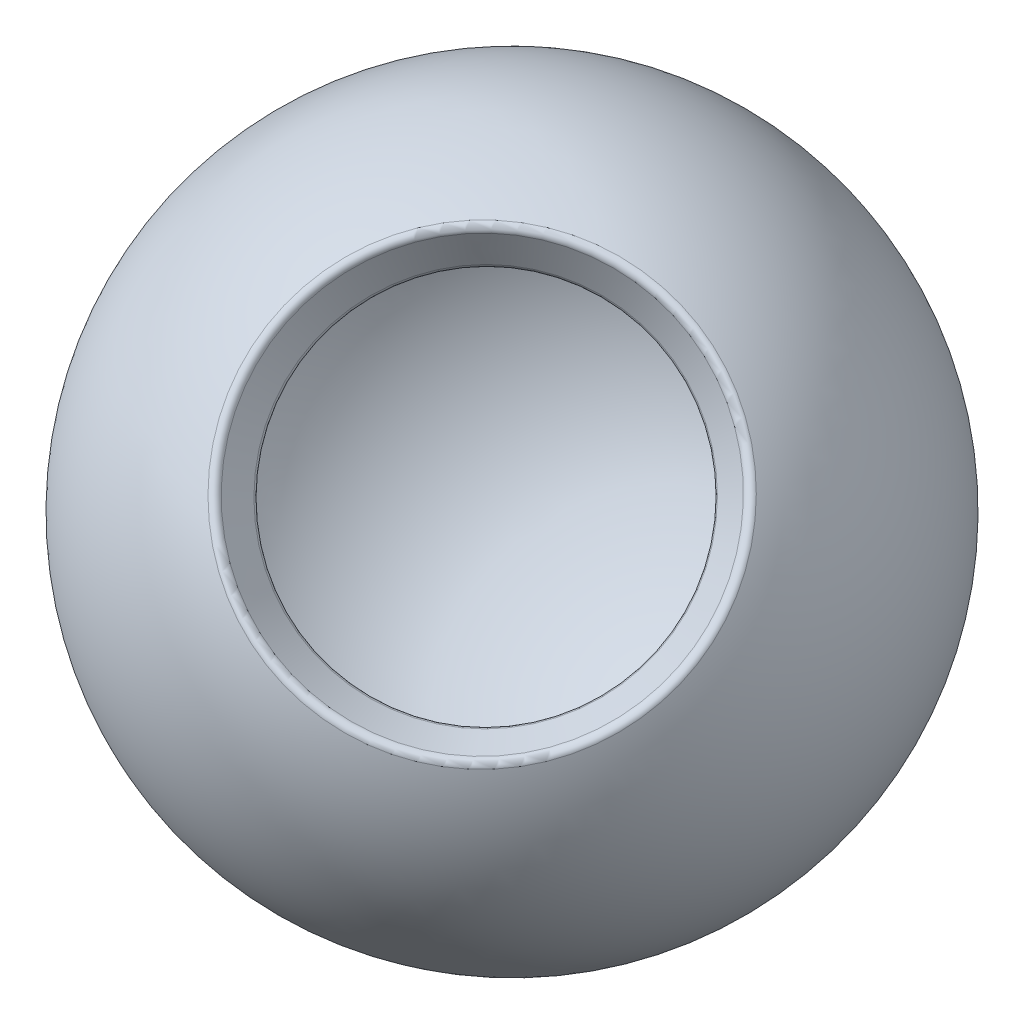
ISO-10303-21;
HEADER;
FILE_DESCRIPTION(('STEP AP214'),'2;1');
FILE_NAME('part.step','',(''),(''),'','','');
FILE_SCHEMA(('AUTOMOTIVE_DESIGN { 1 0 10303 214 1 1 1 1 }'));
ENDSEC;
DATA;
#1=APPLICATION_CONTEXT('core data for automotive mechanical design processes');
#2=APPLICATION_PROTOCOL_DEFINITION('international standard','automotive_design',2000,#1);
#3=PRODUCT_CONTEXT('',#1,'mechanical');
#4=PRODUCT('Part','Part','',(#3));
#5=PRODUCT_RELATED_PRODUCT_CATEGORY('part','',(#4));
#6=PRODUCT_DEFINITION_FORMATION('','',#4);
#7=PRODUCT_DEFINITION_CONTEXT('part definition',#1,'design');
#8=PRODUCT_DEFINITION('design','',#6,#7);
#9=PRODUCT_DEFINITION_SHAPE('','',#8);
#10=(LENGTH_UNIT() NAMED_UNIT(*) SI_UNIT(.MILLI.,.METRE.));
#11=(NAMED_UNIT(*) PLANE_ANGLE_UNIT() SI_UNIT($,.RADIAN.));
#12=(NAMED_UNIT(*) SI_UNIT($,.STERADIAN.) SOLID_ANGLE_UNIT());
#13=UNCERTAINTY_MEASURE_WITH_UNIT(LENGTH_MEASURE(1.E-05),#10,'distance_accuracy_value','');
#14=(GEOMETRIC_REPRESENTATION_CONTEXT(3) GLOBAL_UNCERTAINTY_ASSIGNED_CONTEXT((#13)) GLOBAL_UNIT_ASSIGNED_CONTEXT((#10,
#11,#12)) REPRESENTATION_CONTEXT('',''));
#15=CARTESIAN_POINT('',(0.,0.,0.));
#16=DIRECTION('',(0.,0.,1.));
#17=DIRECTION('',(1.,0.,0.));
#18=AXIS2_PLACEMENT_3D('',#15,#16,#17);
#19=CARTESIAN_POINT('',(5.99661350269087,-5.40320684968999,7.34432163317052));
#20=DIRECTION('',(0.499999999998587,0.612372435695986,0.612372435696757));
#21=DIRECTION('',(0.,-0.707106781186993,0.707106781186102));
#22=AXIS2_PLACEMENT_3D('',#19,#20,#21);
#23=SPHERICAL_SURFACE('',#22,127.);
#24=CARTESIAN_POINT('',(57.2586267623259,57.3796809874527,70.1272094703924));
#25=DIRECTION('',(-0.499999999998587,-0.612372435695986,-0.612372435696757));
#26=DIRECTION('',(0.,0.707106781186993,-0.707106781186102));
#27=AXIS2_PLACEMENT_3D('',#24,#25,#26);
#28=CIRCLE('',#27,74.952144640541);
#29=CARTESIAN_POINT('',(57.2586267623259,110.378850727288,17.1280397306243));
#30=VERTEX_POINT('',#29);
#31=EDGE_CURVE('E10',#30,#30,#28,.T.);
#32=ORIENTED_EDGE('',*,*,#31,.T.);
#33=EDGE_LOOP('',(#32));
#34=FACE_BOUND('',#33,.T.);
#35=ADVANCED_FACE('F32',(#34),#23,.T.);
#36=CARTESIAN_POINT('',(5.99661350269087,-5.40320684968999,7.34432163317052));
#37=DIRECTION('',(0.499999999998587,0.612372435695986,0.612372435696757));
#38=DIRECTION('',(0.,-0.707106781186993,0.707106781186102));
#39=AXIS2_PLACEMENT_3D('',#36,#37,#38);
#40=SPHERICAL_SURFACE('',#39,107.95);
#41=CARTESIAN_POINT('',(49.4869644235496,47.8613773958194,60.608905878747));
#42=DIRECTION('',(-0.499999999998587,-0.612372435695986,-0.612372435696757));
#43=DIRECTION('',(0.,0.707106781186993,-0.707106781186102));
#44=AXIS2_PLACEMENT_3D('',#41,#42,#43);
#45=CIRCLE('',#44,63.934028553498);
#46=CARTESIAN_POINT('',(49.4869644235496,93.0695625346006,15.4007207400228));
#47=VERTEX_POINT('',#46);
#48=EDGE_CURVE('E47',#47,#47,#45,.F.);
#49=ORIENTED_EDGE('',*,*,#48,.T.);
#50=EDGE_LOOP('',(#49));
#51=FACE_BOUND('',#50,.T.);
#52=ADVANCED_FACE('F53',(#51),#40,.F.);
#53=CARTESIAN_POINT('',(50.2103450930642,48.747334160874,61.4948626438027));
#54=DIRECTION('',(0.499999999998587,0.612372435695986,0.612372435696757));
#55=DIRECTION('',(0.,-0.707106781186993,0.707106781186102));
#56=AXIS2_PLACEMENT_3D('',#53,#54,#55);
#57=CONICAL_SURFACE('',#56,61.9175763040956,0.610865238198016);
#58=CARTESIAN_POINT('',(51.2387088723218,50.0068174254486,62.7543459083789));
#59=DIRECTION('',(-0.499999999998587,-0.612372435695986,-0.612372435696757));
#60=DIRECTION('',(0.,0.707106781186993,-0.707106781186102));
#61=AXIS2_PLACEMENT_3D('',#58,#59,#60);
#62=CIRCLE('',#61,63.3577124446156);
#63=CARTESIAN_POINT('',(51.2387088723218,94.8074855355318,17.9536777983521));
#64=VERTEX_POINT('',#63);
#65=EDGE_CURVE('E39',#64,#64,#62,.T.);
#66=ORIENTED_EDGE('',*,*,#65,.T.);
#67=EDGE_LOOP('',(#66));
#68=FACE_BOUND('',#67,.T.);
#69=CARTESIAN_POINT('',(56.961828571297,57.0161789251506,69.7637074080898));
#70=DIRECTION('',(-0.499999999998587,-0.612372435695986,-0.612372435696757));
#71=DIRECTION('',(0.,0.707106781186993,-0.707106781186102));
#72=AXIS2_PLACEMENT_3D('',#69,#70,#71);
#73=CIRCLE('',#72,71.3724555552361);
#74=CARTESIAN_POINT('',(56.961828571297,107.484126238225,19.2957600950786));
#75=VERTEX_POINT('',#74);
#76=EDGE_CURVE('E43',#75,#75,#73,.F.);
#77=ORIENTED_EDGE('',*,*,#76,.T.);
#78=EDGE_LOOP('',(#77));
#79=FACE_BOUND('',#78,.T.);
#80=ADVANCED_FACE('F57',(#68,#79),#57,.F.);
#81=CARTESIAN_POINT('',(50.510266798158,49.1146617310078,61.862190213937));
#82=DIRECTION('',(-0.499999999998587,-0.612372435695986,-0.612372435696757));
#83=DIRECTION('',(0.,0.707106781186993,-0.707106781186102));
#84=AXIS2_PLACEMENT_3D('',#81,#82,#83);
#85=TOROIDAL_SURFACE('',#84,65.4383586371097,2.54);
#86=ORIENTED_EDGE('',*,*,#65,.F.);
#87=EDGE_LOOP('',(#86));
#88=FACE_BOUND('',#87,.T.);
#89=ORIENTED_EDGE('',*,*,#48,.F.);
#90=EDGE_LOOP('',(#89));
#91=FACE_BOUND('',#90,.T.);
#92=ADVANCED_FACE('F55',(#88,#91),#85,.T.);
#93=CARTESIAN_POINT('',(56.2333864971332,56.1240232307099,68.8715517136479));
#94=DIRECTION('',(-0.499999999998587,-0.612372435695986,-0.612372435696757));
#95=DIRECTION('',(0.,0.707106781186993,-0.707106781186102));
#96=AXIS2_PLACEMENT_3D('',#93,#94,#95);
#97=TOROIDAL_SURFACE('',#96,73.4531017477302,2.54);
#98=ORIENTED_EDGE('',*,*,#31,.F.);
#99=EDGE_LOOP('',(#98));
#100=FACE_BOUND('',#99,.T.);
#101=ORIENTED_EDGE('',*,*,#76,.F.);
#102=EDGE_LOOP('',(#101));
#103=FACE_BOUND('',#102,.T.);
#104=ADVANCED_FACE('F34',(#100,#103),#97,.T.);
#105=CLOSED_SHELL('',(#35,#52,#80,#92,#104));
#106=MANIFOLD_SOLID_BREP('B2',#105);
#107=ADVANCED_BREP_SHAPE_REPRESENTATION('',(#18,#106),#14);
#108=SHAPE_DEFINITION_REPRESENTATION(#9,#107);
ENDSEC;
END-ISO-10303-21;
